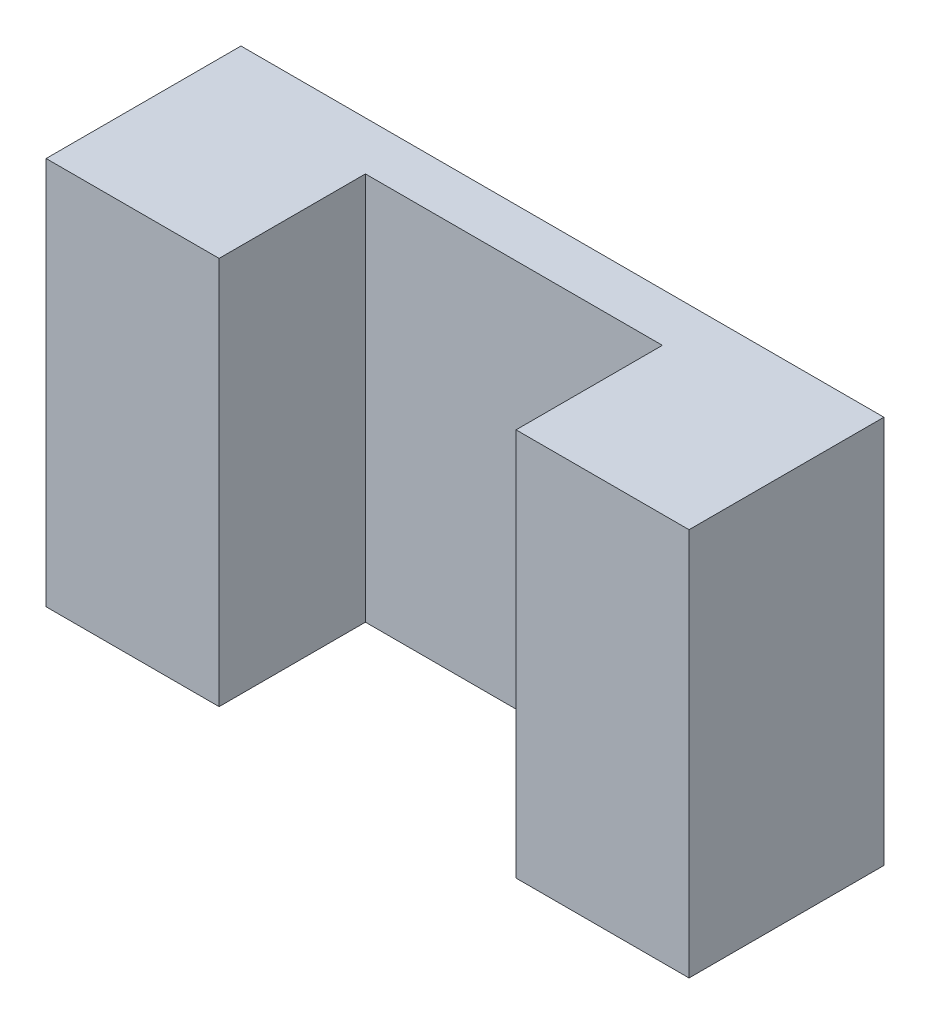
ISO-10303-21;
HEADER;
FILE_DESCRIPTION(('STEP AP214'),'2;1');
FILE_NAME('part.step','',(''),(''),'','','');
FILE_SCHEMA(('AUTOMOTIVE_DESIGN { 1 0 10303 214 1 1 1 1 }'));
ENDSEC;
DATA;
#1=APPLICATION_CONTEXT('core data for automotive mechanical design processes');
#2=APPLICATION_PROTOCOL_DEFINITION('international standard','automotive_design',2000,#1);
#3=PRODUCT_CONTEXT('',#1,'mechanical');
#4=PRODUCT('Part','Part','',(#3));
#5=PRODUCT_RELATED_PRODUCT_CATEGORY('part','',(#4));
#6=PRODUCT_DEFINITION_FORMATION('','',#4);
#7=PRODUCT_DEFINITION_CONTEXT('part definition',#1,'design');
#8=PRODUCT_DEFINITION('design','',#6,#7);
#9=PRODUCT_DEFINITION_SHAPE('','',#8);
#10=(LENGTH_UNIT() NAMED_UNIT(*) SI_UNIT(.MILLI.,.METRE.));
#11=(NAMED_UNIT(*) PLANE_ANGLE_UNIT() SI_UNIT($,.RADIAN.));
#12=(NAMED_UNIT(*) SI_UNIT($,.STERADIAN.) SOLID_ANGLE_UNIT());
#13=UNCERTAINTY_MEASURE_WITH_UNIT(LENGTH_MEASURE(1.E-05),#10,'distance_accuracy_value','');
#14=(GEOMETRIC_REPRESENTATION_CONTEXT(3) GLOBAL_UNCERTAINTY_ASSIGNED_CONTEXT((#13)) GLOBAL_UNIT_ASSIGNED_CONTEXT((#10,
#11,#12)) REPRESENTATION_CONTEXT('',''));
#15=CARTESIAN_POINT('',(0.,0.,0.));
#16=DIRECTION('',(0.,0.,1.));
#17=DIRECTION('',(1.,0.,0.));
#18=AXIS2_PLACEMENT_3D('',#15,#16,#17);
#19=CARTESIAN_POINT('',(0.,0.,20.));
#20=DIRECTION('',(0.,0.,-1.));
#21=DIRECTION('',(-1.,0.,0.));
#22=AXIS2_PLACEMENT_3D('',#19,#20,#21);
#23=PLANE('',#22);
#24=DIRECTION('',(1.,0.,0.));
#25=VECTOR('',#24,1.);
#26=CARTESIAN_POINT('',(32.99688546,-19.925,20.));
#27=LINE('',#26,#25);
#28=CARTESIAN_POINT('',(-32.99688546,-19.925,20.));
#29=VERTEX_POINT('',#28);
#30=CARTESIAN_POINT('',(-15.24,-19.925,20.));
#31=VERTEX_POINT('',#30);
#32=EDGE_CURVE('E85',#29,#31,#27,.T.);
#33=ORIENTED_EDGE('',*,*,#32,.T.);
#34=DIRECTION('',(0.,-1.,0.));
#35=VECTOR('',#34,1.);
#36=CARTESIAN_POINT('',(-15.24,19.925,20.));
#37=LINE('',#36,#35);
#38=CARTESIAN_POINT('',(-15.24,19.925,20.));
#39=VERTEX_POINT('',#38);
#40=EDGE_CURVE('E111',#39,#31,#37,.T.);
#41=ORIENTED_EDGE('',*,*,#40,.F.);
#42=DIRECTION('',(-1.,0.,0.));
#43=VECTOR('',#42,1.);
#44=CARTESIAN_POINT('',(32.99688546,19.925,20.));
#45=LINE('',#44,#43);
#46=CARTESIAN_POINT('',(-32.99688546,19.925,20.));
#47=VERTEX_POINT('',#46);
#48=EDGE_CURVE('E56',#39,#47,#45,.T.);
#49=ORIENTED_EDGE('',*,*,#48,.T.);
#50=DIRECTION('',(0.,-1.,0.));
#51=VECTOR('',#50,1.);
#52=CARTESIAN_POINT('',(-32.99688546,19.925,20.));
#53=LINE('',#52,#51);
#54=EDGE_CURVE('E140',#47,#29,#53,.T.);
#55=ORIENTED_EDGE('',*,*,#54,.T.);
#56=EDGE_LOOP('',(#33,#41,#49,#55));
#57=FACE_BOUND('',#56,.T.);
#58=ADVANCED_FACE('F32',(#57),#23,.F.);
#59=CARTESIAN_POINT('',(-32.99688546,19.925,20.));
#60=DIRECTION('',(1.,0.,0.));
#61=DIRECTION('',(0.,0.,-1.));
#62=AXIS2_PLACEMENT_3D('',#59,#60,#61);
#63=PLANE('',#62);
#64=DIRECTION('',(0.,-1.,0.));
#65=VECTOR('',#64,1.);
#66=CARTESIAN_POINT('',(-32.99688546,19.925,0.));
#67=LINE('',#66,#65);
#68=CARTESIAN_POINT('',(-32.99688546,19.925,0.));
#69=VERTEX_POINT('',#68);
#70=CARTESIAN_POINT('',(-32.99688546,-19.925,0.));
#71=VERTEX_POINT('',#70);
#72=EDGE_CURVE('E135',#69,#71,#67,.T.);
#73=ORIENTED_EDGE('',*,*,#72,.T.);
#74=DIRECTION('',(0.,0.,-1.));
#75=VECTOR('',#74,1.);
#76=CARTESIAN_POINT('',(-32.99688546,-19.925,20.));
#77=LINE('',#76,#75);
#78=EDGE_CURVE('E11',#29,#71,#77,.T.);
#79=ORIENTED_EDGE('',*,*,#78,.F.);
#80=ORIENTED_EDGE('',*,*,#54,.F.);
#81=DIRECTION('',(0.,0.,-1.));
#82=VECTOR('',#81,1.);
#83=CARTESIAN_POINT('',(-32.99688546,19.925,20.));
#84=LINE('',#83,#82);
#85=EDGE_CURVE('E149',#47,#69,#84,.T.);
#86=ORIENTED_EDGE('',*,*,#85,.T.);
#87=EDGE_LOOP('',(#73,#79,#80,#86));
#88=FACE_BOUND('',#87,.T.);
#89=ADVANCED_FACE('F34',(#88),#63,.F.);
#90=CARTESIAN_POINT('',(32.99688546,-19.925,20.));
#91=DIRECTION('',(0.,1.,0.));
#92=DIRECTION('',(-1.,0.,0.));
#93=AXIS2_PLACEMENT_3D('',#90,#91,#92);
#94=PLANE('',#93);
#95=DIRECTION('',(1.,0.,0.));
#96=VECTOR('',#95,1.);
#97=CARTESIAN_POINT('',(15.24,-19.925,4.98));
#98=LINE('',#97,#96);
#99=CARTESIAN_POINT('',(-15.24,-19.925,4.98));
#100=VERTEX_POINT('',#99);
#101=CARTESIAN_POINT('',(15.24,-19.925,4.98));
#102=VERTEX_POINT('',#101);
#103=EDGE_CURVE('E119',#100,#102,#98,.T.);
#104=ORIENTED_EDGE('',*,*,#103,.F.);
#105=DIRECTION('',(0.,0.,1.));
#106=VECTOR('',#105,1.);
#107=CARTESIAN_POINT('',(-15.24,-19.925,4.98));
#108=LINE('',#107,#106);
#109=EDGE_CURVE('E106',#100,#31,#108,.T.);
#110=ORIENTED_EDGE('',*,*,#109,.T.);
#111=ORIENTED_EDGE('',*,*,#32,.F.);
#112=ORIENTED_EDGE('',*,*,#78,.T.);
#113=DIRECTION('',(1.,0.,0.));
#114=VECTOR('',#113,1.);
#115=CARTESIAN_POINT('',(32.99688546,-19.925,0.));
#116=LINE('',#115,#114);
#117=CARTESIAN_POINT('',(32.99688546,-19.925,0.));
#118=VERTEX_POINT('',#117);
#119=EDGE_CURVE('E152',#71,#118,#116,.T.);
#120=ORIENTED_EDGE('',*,*,#119,.T.);
#121=DIRECTION('',(0.,0.,-1.));
#122=VECTOR('',#121,1.);
#123=CARTESIAN_POINT('',(32.99688546,-19.925,20.));
#124=LINE('',#123,#122);
#125=CARTESIAN_POINT('',(32.99688546,-19.925,20.));
#126=VERTEX_POINT('',#125);
#127=EDGE_CURVE('E40',#126,#118,#124,.T.);
#128=ORIENTED_EDGE('',*,*,#127,.F.);
#129=CARTESIAN_POINT('',(15.24,-19.925,20.));
#130=VERTEX_POINT('',#129);
#131=EDGE_CURVE('E142',#130,#126,#27,.T.);
#132=ORIENTED_EDGE('',*,*,#131,.F.);
#133=DIRECTION('',(0.,0.,1.));
#134=VECTOR('',#133,1.);
#135=CARTESIAN_POINT('',(15.24,-19.925,4.98));
#136=LINE('',#135,#134);
#137=EDGE_CURVE('E47',#102,#130,#136,.T.);
#138=ORIENTED_EDGE('',*,*,#137,.F.);
#139=EDGE_LOOP('',(#104,#110,#111,#112,#120,#128,#132,#138));
#140=FACE_BOUND('',#139,.T.);
#141=ADVANCED_FACE('F124',(#140),#94,.F.);
#142=CARTESIAN_POINT('',(32.99688546,19.925,20.));
#143=DIRECTION('',(-1.,0.,0.));
#144=DIRECTION('',(0.,-1.,0.));
#145=AXIS2_PLACEMENT_3D('',#142,#143,#144);
#146=PLANE('',#145);
#147=DIRECTION('',(0.,1.,0.));
#148=VECTOR('',#147,1.);
#149=CARTESIAN_POINT('',(32.99688546,19.925,0.));
#150=LINE('',#149,#148);
#151=CARTESIAN_POINT('',(32.99688546,19.925,0.));
#152=VERTEX_POINT('',#151);
#153=EDGE_CURVE('E154',#118,#152,#150,.T.);
#154=ORIENTED_EDGE('',*,*,#153,.T.);
#155=DIRECTION('',(0.,0.,-1.));
#156=VECTOR('',#155,1.);
#157=CARTESIAN_POINT('',(32.99688546,19.925,20.));
#158=LINE('',#157,#156);
#159=CARTESIAN_POINT('',(32.99688546,19.925,20.));
#160=VERTEX_POINT('',#159);
#161=EDGE_CURVE('E158',#160,#152,#158,.T.);
#162=ORIENTED_EDGE('',*,*,#161,.F.);
#163=DIRECTION('',(0.,1.,0.));
#164=VECTOR('',#163,1.);
#165=CARTESIAN_POINT('',(32.99688546,19.925,20.));
#166=LINE('',#165,#164);
#167=EDGE_CURVE('E144',#126,#160,#166,.T.);
#168=ORIENTED_EDGE('',*,*,#167,.F.);
#169=ORIENTED_EDGE('',*,*,#127,.T.);
#170=EDGE_LOOP('',(#154,#162,#168,#169));
#171=FACE_BOUND('',#170,.T.);
#172=ADVANCED_FACE('F164',(#171),#146,.F.);
#173=CARTESIAN_POINT('',(32.99688546,19.925,20.));
#174=DIRECTION('',(0.,-1.,0.));
#175=DIRECTION('',(1.,0.,0.));
#176=AXIS2_PLACEMENT_3D('',#173,#174,#175);
#177=PLANE('',#176);
#178=ORIENTED_EDGE('',*,*,#48,.F.);
#179=DIRECTION('',(0.,0.,1.));
#180=VECTOR('',#179,1.);
#181=CARTESIAN_POINT('',(-15.24,19.925,4.98));
#182=LINE('',#181,#180);
#183=CARTESIAN_POINT('',(-15.24,19.925,4.98));
#184=VERTEX_POINT('',#183);
#185=EDGE_CURVE('E133',#184,#39,#182,.T.);
#186=ORIENTED_EDGE('',*,*,#185,.F.);
#187=DIRECTION('',(-1.,0.,0.));
#188=VECTOR('',#187,1.);
#189=CARTESIAN_POINT('',(15.24,19.925,4.98));
#190=LINE('',#189,#188);
#191=CARTESIAN_POINT('',(15.24,19.925,4.98));
#192=VERTEX_POINT('',#191);
#193=EDGE_CURVE('E113',#192,#184,#190,.T.);
#194=ORIENTED_EDGE('',*,*,#193,.F.);
#195=DIRECTION('',(0.,0.,1.));
#196=VECTOR('',#195,1.);
#197=CARTESIAN_POINT('',(15.24,19.925,4.98));
#198=LINE('',#197,#196);
#199=CARTESIAN_POINT('',(15.24,19.925,20.));
#200=VERTEX_POINT('',#199);
#201=EDGE_CURVE('E136',#192,#200,#198,.T.);
#202=ORIENTED_EDGE('',*,*,#201,.T.);
#203=EDGE_CURVE('E146',#160,#200,#45,.T.);
#204=ORIENTED_EDGE('',*,*,#203,.F.);
#205=ORIENTED_EDGE('',*,*,#161,.T.);
#206=DIRECTION('',(-1.,0.,0.));
#207=VECTOR('',#206,1.);
#208=CARTESIAN_POINT('',(32.99688546,19.925,0.));
#209=LINE('',#208,#207);
#210=EDGE_CURVE('E78',#152,#69,#209,.T.);
#211=ORIENTED_EDGE('',*,*,#210,.T.);
#212=ORIENTED_EDGE('',*,*,#85,.F.);
#213=EDGE_LOOP('',(#178,#186,#194,#202,#204,#205,#211,#212));
#214=FACE_BOUND('',#213,.T.);
#215=ADVANCED_FACE('F172',(#214),#177,.F.);
#216=ORIENTED_EDGE('',*,*,#203,.T.);
#217=DIRECTION('',(0.,1.,0.));
#218=VECTOR('',#217,1.);
#219=CARTESIAN_POINT('',(15.24,19.925,20.));
#220=LINE('',#219,#218);
#221=EDGE_CURVE('E122',#130,#200,#220,.T.);
#222=ORIENTED_EDGE('',*,*,#221,.F.);
#223=ORIENTED_EDGE('',*,*,#131,.T.);
#224=ORIENTED_EDGE('',*,*,#167,.T.);
#225=EDGE_LOOP('',(#216,#222,#223,#224));
#226=FACE_BOUND('',#225,.T.);
#227=ADVANCED_FACE('F175',(#226),#23,.F.);
#228=CARTESIAN_POINT('',(0.,0.,0.));
#229=DIRECTION('',(0.,0.,-1.));
#230=DIRECTION('',(-1.,0.,0.));
#231=AXIS2_PLACEMENT_3D('',#228,#229,#230);
#232=PLANE('',#231);
#233=ORIENTED_EDGE('',*,*,#72,.F.);
#234=ORIENTED_EDGE('',*,*,#210,.F.);
#235=ORIENTED_EDGE('',*,*,#153,.F.);
#236=ORIENTED_EDGE('',*,*,#119,.F.);
#237=EDGE_LOOP('',(#233,#234,#235,#236));
#238=FACE_BOUND('',#237,.T.);
#239=ADVANCED_FACE('F168',(#238),#232,.T.);
#240=CARTESIAN_POINT('',(-15.24,19.925,4.98));
#241=DIRECTION('',(-1.,0.,0.));
#242=DIRECTION('',(0.,0.,1.));
#243=AXIS2_PLACEMENT_3D('',#240,#241,#242);
#244=PLANE('',#243);
#245=ORIENTED_EDGE('',*,*,#40,.T.);
#246=ORIENTED_EDGE('',*,*,#109,.F.);
#247=DIRECTION('',(0.,-1.,0.));
#248=VECTOR('',#247,1.);
#249=CARTESIAN_POINT('',(-15.24,19.925,4.98));
#250=LINE('',#249,#248);
#251=EDGE_CURVE('E109',#184,#100,#250,.T.);
#252=ORIENTED_EDGE('',*,*,#251,.F.);
#253=ORIENTED_EDGE('',*,*,#185,.T.);
#254=EDGE_LOOP('',(#245,#246,#252,#253));
#255=FACE_BOUND('',#254,.T.);
#256=ADVANCED_FACE('F108',(#255),#244,.F.);
#257=CARTESIAN_POINT('',(15.24,19.925,4.98));
#258=DIRECTION('',(1.,0.,0.));
#259=DIRECTION('',(0.,0.,-1.));
#260=AXIS2_PLACEMENT_3D('',#257,#258,#259);
#261=PLANE('',#260);
#262=ORIENTED_EDGE('',*,*,#221,.T.);
#263=ORIENTED_EDGE('',*,*,#201,.F.);
#264=DIRECTION('',(0.,1.,0.));
#265=VECTOR('',#264,1.);
#266=CARTESIAN_POINT('',(15.24,19.925,4.98));
#267=LINE('',#266,#265);
#268=EDGE_CURVE('E126',#102,#192,#267,.T.);
#269=ORIENTED_EDGE('',*,*,#268,.F.);
#270=ORIENTED_EDGE('',*,*,#137,.T.);
#271=EDGE_LOOP('',(#262,#263,#269,#270));
#272=FACE_BOUND('',#271,.T.);
#273=ADVANCED_FACE('F189',(#272),#261,.F.);
#274=CARTESIAN_POINT('',(0.,0.,4.98));
#275=DIRECTION('',(0.,0.,-1.));
#276=DIRECTION('',(-1.,0.,0.));
#277=AXIS2_PLACEMENT_3D('',#274,#275,#276);
#278=PLANE('',#277);
#279=ORIENTED_EDGE('',*,*,#251,.T.);
#280=ORIENTED_EDGE('',*,*,#103,.T.);
#281=ORIENTED_EDGE('',*,*,#268,.T.);
#282=ORIENTED_EDGE('',*,*,#193,.T.);
#283=EDGE_LOOP('',(#279,#280,#281,#282));
#284=FACE_BOUND('',#283,.T.);
#285=ADVANCED_FACE('F117',(#284),#278,.F.);
#286=CLOSED_SHELL('',(#58,#89,#141,#172,#215,#227,#239,#256,#273,#285));
#287=MANIFOLD_SOLID_BREP('B2',#286);
#288=ADVANCED_BREP_SHAPE_REPRESENTATION('',(#18,#287),#14);
#289=SHAPE_DEFINITION_REPRESENTATION(#9,#288);
ENDSEC;
END-ISO-10303-21;
